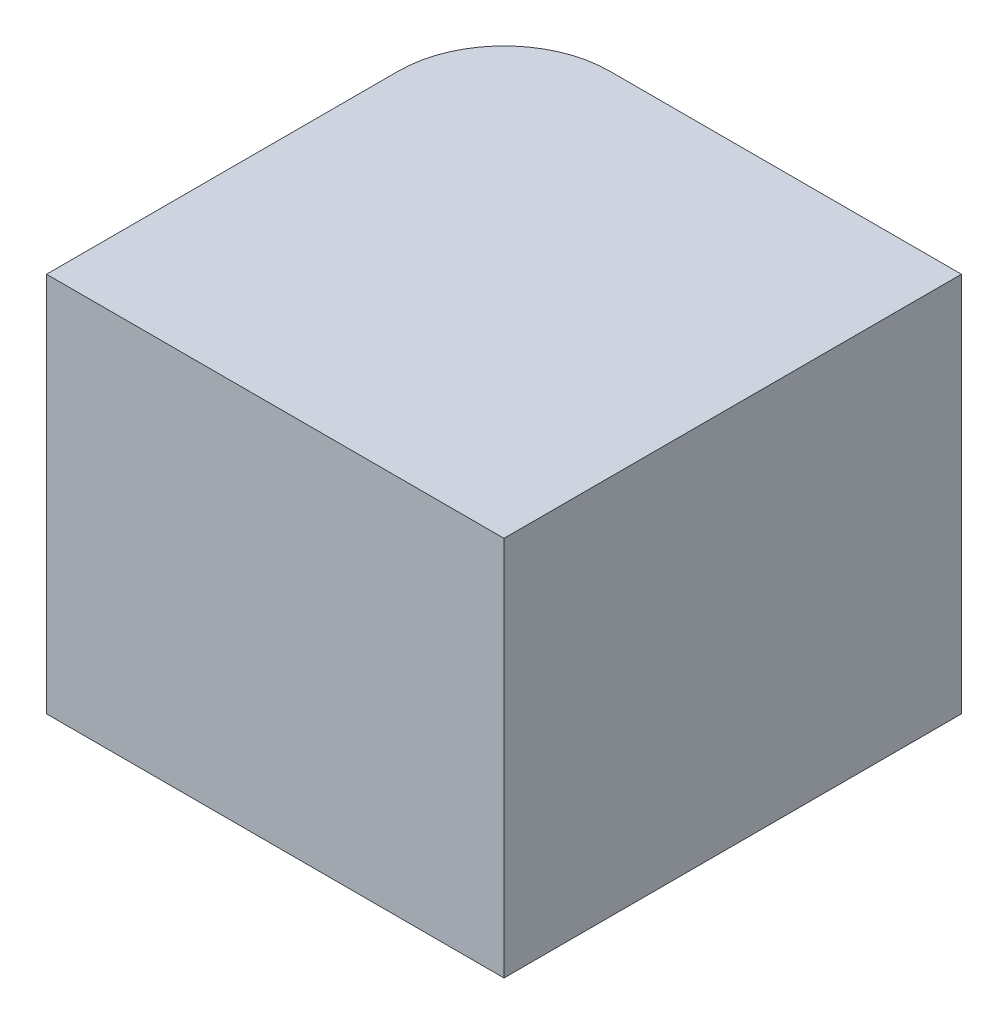
ISO-10303-21;
HEADER;
FILE_DESCRIPTION(('STEP AP214'),'2;1');
FILE_NAME('part.step','',(''),(''),'','','');
FILE_SCHEMA(('AUTOMOTIVE_DESIGN { 1 0 10303 214 1 1 1 1 }'));
ENDSEC;
DATA;
#1=APPLICATION_CONTEXT('core data for automotive mechanical design processes');
#2=APPLICATION_PROTOCOL_DEFINITION('international standard','automotive_design',2000,#1);
#3=PRODUCT_CONTEXT('',#1,'mechanical');
#4=PRODUCT('Part','Part','',(#3));
#5=PRODUCT_RELATED_PRODUCT_CATEGORY('part','',(#4));
#6=PRODUCT_DEFINITION_FORMATION('','',#4);
#7=PRODUCT_DEFINITION_CONTEXT('part definition',#1,'design');
#8=PRODUCT_DEFINITION('design','',#6,#7);
#9=PRODUCT_DEFINITION_SHAPE('','',#8);
#10=(LENGTH_UNIT() NAMED_UNIT(*) SI_UNIT(.MILLI.,.METRE.));
#11=(NAMED_UNIT(*) PLANE_ANGLE_UNIT() SI_UNIT($,.RADIAN.));
#12=(NAMED_UNIT(*) SI_UNIT($,.STERADIAN.) SOLID_ANGLE_UNIT());
#13=UNCERTAINTY_MEASURE_WITH_UNIT(LENGTH_MEASURE(1.E-05),#10,'distance_accuracy_value','');
#14=(GEOMETRIC_REPRESENTATION_CONTEXT(3) GLOBAL_UNCERTAINTY_ASSIGNED_CONTEXT((#13)) GLOBAL_UNIT_ASSIGNED_CONTEXT((#10,
#11,#12)) REPRESENTATION_CONTEXT('',''));
#15=CARTESIAN_POINT('',(0.,0.,0.));
#16=DIRECTION('',(0.,0.,1.));
#17=DIRECTION('',(1.,0.,0.));
#18=AXIS2_PLACEMENT_3D('',#15,#16,#17);
#19=CARTESIAN_POINT('',(8.65,7.2,0.));
#20=DIRECTION('',(0.,0.,-1.));
#21=DIRECTION('',(-1.,0.,0.));
#22=AXIS2_PLACEMENT_3D('',#19,#20,#21);
#23=PLANE('',#22);
#24=DIRECTION('',(1.,0.,0.));
#25=VECTOR('',#24,1.);
#26=CARTESIAN_POINT('',(8.65,0.,0.));
#27=LINE('',#26,#25);
#28=CARTESIAN_POINT('',(0.,0.,0.));
#29=VERTEX_POINT('',#28);
#30=CARTESIAN_POINT('',(8.65,0.,0.));
#31=VERTEX_POINT('',#30);
#32=EDGE_CURVE('E101',#29,#31,#27,.T.);
#33=ORIENTED_EDGE('',*,*,#32,.T.);
#34=DIRECTION('',(0.,-1.,0.));
#35=VECTOR('',#34,1.);
#36=CARTESIAN_POINT('',(8.65,7.2,0.));
#37=LINE('',#36,#35);
#38=CARTESIAN_POINT('',(8.65,7.2,0.));
#39=VERTEX_POINT('',#38);
#40=EDGE_CURVE('E83',#39,#31,#37,.T.);
#41=ORIENTED_EDGE('',*,*,#40,.F.);
#42=DIRECTION('',(1.,0.,0.));
#43=VECTOR('',#42,1.);
#44=CARTESIAN_POINT('',(8.65,7.2,0.));
#45=LINE('',#44,#43);
#46=CARTESIAN_POINT('',(0.,7.2,0.));
#47=VERTEX_POINT('',#46);
#48=EDGE_CURVE('E89',#47,#39,#45,.T.);
#49=ORIENTED_EDGE('',*,*,#48,.F.);
#50=DIRECTION('',(0.,-1.,0.));
#51=VECTOR('',#50,1.);
#52=CARTESIAN_POINT('',(0.,7.2,0.));
#53=LINE('',#52,#51);
#54=EDGE_CURVE('E106',#47,#29,#53,.T.);
#55=ORIENTED_EDGE('',*,*,#54,.T.);
#56=EDGE_LOOP('',(#33,#41,#49,#55));
#57=FACE_BOUND('',#56,.T.);
#58=ADVANCED_FACE('F32',(#57),#23,.F.);
#59=CARTESIAN_POINT('',(8.65,7.2,-8.65));
#60=DIRECTION('',(-1.,0.,0.));
#61=DIRECTION('',(0.,0.,1.));
#62=AXIS2_PLACEMENT_3D('',#59,#60,#61);
#63=PLANE('',#62);
#64=DIRECTION('',(0.,0.,-1.));
#65=VECTOR('',#64,1.);
#66=CARTESIAN_POINT('',(8.65,0.,-8.65));
#67=LINE('',#66,#65);
#68=CARTESIAN_POINT('',(8.65,0.,-8.65));
#69=VERTEX_POINT('',#68);
#70=EDGE_CURVE('E114',#31,#69,#67,.T.);
#71=ORIENTED_EDGE('',*,*,#70,.T.);
#72=DIRECTION('',(0.,-1.,0.));
#73=VECTOR('',#72,1.);
#74=CARTESIAN_POINT('',(8.65,7.2,-8.65));
#75=LINE('',#74,#73);
#76=CARTESIAN_POINT('',(8.65,7.2,-8.65));
#77=VERTEX_POINT('',#76);
#78=EDGE_CURVE('E86',#77,#69,#75,.T.);
#79=ORIENTED_EDGE('',*,*,#78,.F.);
#80=DIRECTION('',(0.,0.,-1.));
#81=VECTOR('',#80,1.);
#82=CARTESIAN_POINT('',(8.65,7.2,-8.65));
#83=LINE('',#82,#81);
#84=EDGE_CURVE('E79',#39,#77,#83,.T.);
#85=ORIENTED_EDGE('',*,*,#84,.F.);
#86=ORIENTED_EDGE('',*,*,#40,.T.);
#87=EDGE_LOOP('',(#71,#79,#85,#86));
#88=FACE_BOUND('',#87,.T.);
#89=ADVANCED_FACE('F81',(#88),#63,.F.);
#90=CARTESIAN_POINT('',(0.,7.2,-8.65));
#91=DIRECTION('',(0.,0.,1.));
#92=DIRECTION('',(1.,0.,0.));
#93=AXIS2_PLACEMENT_3D('',#90,#91,#92);
#94=PLANE('',#93);
#95=DIRECTION('',(-1.,0.,0.));
#96=VECTOR('',#95,1.);
#97=CARTESIAN_POINT('',(0.,0.,-8.65));
#98=LINE('',#97,#96);
#99=CARTESIAN_POINT('',(2.,0.,-8.65));
#100=VERTEX_POINT('',#99);
#101=EDGE_CURVE('E112',#69,#100,#98,.T.);
#102=ORIENTED_EDGE('',*,*,#101,.T.);
#103=DIRECTION('',(0.,-1.,0.));
#104=VECTOR('',#103,1.);
#105=CARTESIAN_POINT('',(2.,7.2,-8.65));
#106=LINE('',#105,#104);
#107=CARTESIAN_POINT('',(2.,7.2,-8.65));
#108=VERTEX_POINT('',#107);
#109=EDGE_CURVE('E40',#100,#108,#106,.F.);
#110=ORIENTED_EDGE('',*,*,#109,.T.);
#111=DIRECTION('',(-1.,0.,0.));
#112=VECTOR('',#111,1.);
#113=CARTESIAN_POINT('',(0.,7.2,-8.65));
#114=LINE('',#113,#112);
#115=EDGE_CURVE('E88',#77,#108,#114,.T.);
#116=ORIENTED_EDGE('',*,*,#115,.F.);
#117=ORIENTED_EDGE('',*,*,#78,.T.);
#118=EDGE_LOOP('',(#102,#110,#116,#117));
#119=FACE_BOUND('',#118,.T.);
#120=ADVANCED_FACE('F124',(#119),#94,.F.);
#121=CARTESIAN_POINT('',(0.,7.2,0.));
#122=DIRECTION('',(1.,0.,0.));
#123=DIRECTION('',(0.,0.,-1.));
#124=AXIS2_PLACEMENT_3D('',#121,#122,#123);
#125=PLANE('',#124);
#126=DIRECTION('',(0.,0.,1.));
#127=VECTOR('',#126,1.);
#128=CARTESIAN_POINT('',(0.,7.2,0.));
#129=LINE('',#128,#127);
#130=CARTESIAN_POINT('',(0.,7.2,-6.65));
#131=VERTEX_POINT('',#130);
#132=EDGE_CURVE('E94',#131,#47,#129,.T.);
#133=ORIENTED_EDGE('',*,*,#132,.F.);
#134=DIRECTION('',(0.,-1.,0.));
#135=VECTOR('',#134,1.);
#136=CARTESIAN_POINT('',(0.,7.2,-6.65));
#137=LINE('',#136,#135);
#138=CARTESIAN_POINT('',(0.,0.,-6.65));
#139=VERTEX_POINT('',#138);
#140=EDGE_CURVE('E102',#131,#139,#137,.T.);
#141=ORIENTED_EDGE('',*,*,#140,.T.);
#142=DIRECTION('',(0.,0.,1.));
#143=VECTOR('',#142,1.);
#144=CARTESIAN_POINT('',(0.,0.,0.));
#145=LINE('',#144,#143);
#146=EDGE_CURVE('E98',#139,#29,#145,.T.);
#147=ORIENTED_EDGE('',*,*,#146,.T.);
#148=ORIENTED_EDGE('',*,*,#54,.F.);
#149=EDGE_LOOP('',(#133,#141,#147,#148));
#150=FACE_BOUND('',#149,.T.);
#151=ADVANCED_FACE('F122',(#150),#125,.F.);
#152=CARTESIAN_POINT('',(0.,7.2,0.));
#153=DIRECTION('',(0.,-1.,0.));
#154=DIRECTION('',(0.,0.,-1.));
#155=AXIS2_PLACEMENT_3D('',#152,#153,#154);
#156=PLANE('',#155);
#157=ORIENTED_EDGE('',*,*,#115,.T.);
#158=CARTESIAN_POINT('',(2.,7.2,-6.65));
#159=DIRECTION('',(0.,-1.,0.));
#160=DIRECTION('',(0.,0.,-1.));
#161=AXIS2_PLACEMENT_3D('',#158,#159,#160);
#162=CIRCLE('',#161,2.);
#163=EDGE_CURVE('E11',#108,#131,#162,.F.);
#164=ORIENTED_EDGE('',*,*,#163,.T.);
#165=ORIENTED_EDGE('',*,*,#132,.T.);
#166=ORIENTED_EDGE('',*,*,#48,.T.);
#167=ORIENTED_EDGE('',*,*,#84,.T.);
#168=EDGE_LOOP('',(#157,#164,#165,#166,#167));
#169=FACE_BOUND('',#168,.T.);
#170=ADVANCED_FACE('F92',(#169),#156,.F.);
#171=CARTESIAN_POINT('',(0.,0.,0.));
#172=DIRECTION('',(0.,-1.,0.));
#173=DIRECTION('',(0.,0.,-1.));
#174=AXIS2_PLACEMENT_3D('',#171,#172,#173);
#175=PLANE('',#174);
#176=ORIENTED_EDGE('',*,*,#146,.F.);
#177=CARTESIAN_POINT('',(2.,0.,-6.65));
#178=DIRECTION('',(0.,-1.,0.));
#179=DIRECTION('',(0.,0.,-1.));
#180=AXIS2_PLACEMENT_3D('',#177,#178,#179);
#181=CIRCLE('',#180,2.);
#182=EDGE_CURVE('E54',#139,#100,#181,.T.);
#183=ORIENTED_EDGE('',*,*,#182,.T.);
#184=ORIENTED_EDGE('',*,*,#101,.F.);
#185=ORIENTED_EDGE('',*,*,#70,.F.);
#186=ORIENTED_EDGE('',*,*,#32,.F.);
#187=EDGE_LOOP('',(#176,#183,#184,#185,#186));
#188=FACE_BOUND('',#187,.T.);
#189=ADVANCED_FACE('F123',(#188),#175,.T.);
#190=CARTESIAN_POINT('',(2.,7.2,-6.65));
#191=DIRECTION('',(0.,-1.,0.));
#192=DIRECTION('',(0.,0.,-1.));
#193=AXIS2_PLACEMENT_3D('',#190,#191,#192);
#194=CYLINDRICAL_SURFACE('',#193,2.);
#195=ORIENTED_EDGE('',*,*,#163,.F.);
#196=ORIENTED_EDGE('',*,*,#109,.F.);
#197=ORIENTED_EDGE('',*,*,#182,.F.);
#198=ORIENTED_EDGE('',*,*,#140,.F.);
#199=EDGE_LOOP('',(#195,#196,#197,#198));
#200=FACE_BOUND('',#199,.T.);
#201=ADVANCED_FACE('F34',(#200),#194,.T.);
#202=CLOSED_SHELL('',(#58,#89,#120,#151,#170,#189,#201));
#203=MANIFOLD_SOLID_BREP('B2',#202);
#204=ADVANCED_BREP_SHAPE_REPRESENTATION('',(#18,#203),#14);
#205=SHAPE_DEFINITION_REPRESENTATION(#9,#204);
ENDSEC;
END-ISO-10303-21;
